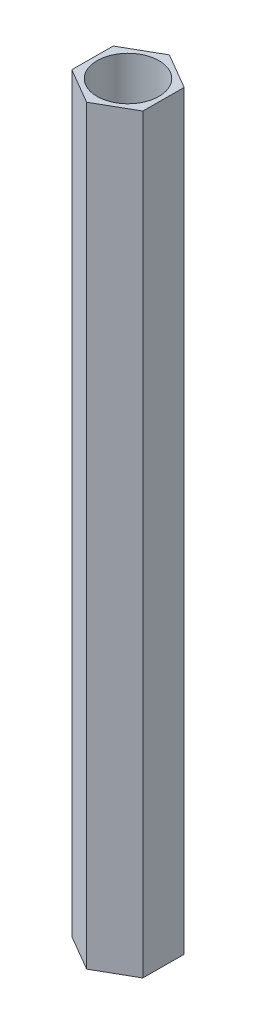
ISO-10303-21;
HEADER;
FILE_DESCRIPTION(('STEP AP214'),'2;1');
FILE_NAME('part.step','',(''),(''),'','','');
FILE_SCHEMA(('AUTOMOTIVE_DESIGN { 1 0 10303 214 1 1 1 1 }'));
ENDSEC;
DATA;
#1=APPLICATION_CONTEXT('core data for automotive mechanical design processes');
#2=APPLICATION_PROTOCOL_DEFINITION('international standard','automotive_design',2000,#1);
#3=PRODUCT_CONTEXT('',#1,'mechanical');
#4=PRODUCT('Part','Part','',(#3));
#5=PRODUCT_RELATED_PRODUCT_CATEGORY('part','',(#4));
#6=PRODUCT_DEFINITION_FORMATION('','',#4);
#7=PRODUCT_DEFINITION_CONTEXT('part definition',#1,'design');
#8=PRODUCT_DEFINITION('design','',#6,#7);
#9=PRODUCT_DEFINITION_SHAPE('','',#8);
#10=(LENGTH_UNIT() NAMED_UNIT(*) SI_UNIT(.MILLI.,.METRE.));
#11=(NAMED_UNIT(*) PLANE_ANGLE_UNIT() SI_UNIT($,.RADIAN.));
#12=(NAMED_UNIT(*) SI_UNIT($,.STERADIAN.) SOLID_ANGLE_UNIT());
#13=UNCERTAINTY_MEASURE_WITH_UNIT(LENGTH_MEASURE(1.E-05),#10,'distance_accuracy_value','');
#14=(GEOMETRIC_REPRESENTATION_CONTEXT(3) GLOBAL_UNCERTAINTY_ASSIGNED_CONTEXT((#13)) GLOBAL_UNIT_ASSIGNED_CONTEXT((#10,
#11,#12)) REPRESENTATION_CONTEXT('',''));
#15=CARTESIAN_POINT('',(0.,0.,0.));
#16=DIRECTION('',(0.,0.,1.));
#17=DIRECTION('',(1.,0.,0.));
#18=AXIS2_PLACEMENT_3D('',#15,#16,#17);
#19=CARTESIAN_POINT('',(0.,40.,0.));
#20=DIRECTION('',(0.,1.,0.));
#21=DIRECTION('',(0.,0.,1.));
#22=AXIS2_PLACEMENT_3D('',#19,#20,#21);
#23=PLANE('',#22);
#24=DIRECTION('',(0.868520271452381,0.,-0.495653647294442));
#25=VECTOR('',#24,1.);
#26=CARTESIAN_POINT('',(-0.0109948539279505,40.,2.19390347247103));
#27=LINE('',#26,#25);
#28=CARTESIAN_POINT('',(-0.0109948539279505,40.,2.19390347247103));
#29=VERTEX_POINT('',#28);
#30=CARTESIAN_POINT('',(1.89447871364683,40.,1.10647355904802));
#31=VERTEX_POINT('',#30);
#32=EDGE_CURVE('E129',#29,#31,#27,.T.);
#33=ORIENTED_EDGE('',*,*,#32,.T.);
#34=DIRECTION('',(0.00501148569079173,0.,-0.999987442426739));
#35=VECTOR('',#34,1.);
#36=CARTESIAN_POINT('',(1.89447871364683,40.,1.10647355904802));
#37=LINE('',#36,#35);
#38=CARTESIAN_POINT('',(1.90547356757478,40.,-1.08742991342301));
#39=VERTEX_POINT('',#38);
#40=EDGE_CURVE('E87',#31,#39,#37,.T.);
#41=ORIENTED_EDGE('',*,*,#40,.T.);
#42=DIRECTION('',(-0.863508785761589,0.,-0.504333795132298));
#43=VECTOR('',#42,1.);
#44=CARTESIAN_POINT('',(1.90547356757478,40.,-1.08742991342301));
#45=LINE('',#44,#43);
#46=CARTESIAN_POINT('',(0.0109948539279514,40.,-2.19390347247103));
#47=VERTEX_POINT('',#46);
#48=EDGE_CURVE('E100',#39,#47,#45,.T.);
#49=ORIENTED_EDGE('',*,*,#48,.T.);
#50=DIRECTION('',(-0.868520271452381,0.,0.495653647294441));
#51=VECTOR('',#50,1.);
#52=CARTESIAN_POINT('',(0.0109948539279514,40.,-2.19390347247103));
#53=LINE('',#52,#51);
#54=CARTESIAN_POINT('',(-1.89447871364683,40.,-1.10647355904802));
#55=VERTEX_POINT('',#54);
#56=EDGE_CURVE('E94',#47,#55,#53,.T.);
#57=ORIENTED_EDGE('',*,*,#56,.T.);
#58=DIRECTION('',(-0.00501148569079203,0.,0.999987442426739));
#59=VECTOR('',#58,1.);
#60=CARTESIAN_POINT('',(-1.89447871364683,40.,-1.10647355904802));
#61=LINE('',#60,#59);
#62=CARTESIAN_POINT('',(-1.90547356757478,40.,1.08742991342301));
#63=VERTEX_POINT('',#62);
#64=EDGE_CURVE('E98',#55,#63,#61,.T.);
#65=ORIENTED_EDGE('',*,*,#64,.T.);
#66=DIRECTION('',(0.863508785761589,0.,0.504333795132298));
#67=VECTOR('',#66,1.);
#68=CARTESIAN_POINT('',(-1.90547356757478,40.,1.08742991342301));
#69=LINE('',#68,#67);
#70=EDGE_CURVE('E50',#63,#29,#69,.T.);
#71=ORIENTED_EDGE('',*,*,#70,.T.);
#72=EDGE_LOOP('',(#33,#41,#49,#57,#65,#71));
#73=FACE_BOUND('',#72,.T.);
#74=CARTESIAN_POINT('',(0.,40.,0.));
#75=DIRECTION('',(0.,1.,0.));
#76=DIRECTION('',(0.,0.,1.));
#77=AXIS2_PLACEMENT_3D('',#74,#75,#76);
#78=CIRCLE('',#77,1.65);
#79=CARTESIAN_POINT('',(0.,40.,1.65));
#80=VERTEX_POINT('',#79);
#81=EDGE_CURVE('E122',#80,#80,#78,.T.);
#82=ORIENTED_EDGE('',*,*,#81,.F.);
#83=EDGE_LOOP('',(#82));
#84=FACE_BOUND('',#83,.T.);
#85=ADVANCED_FACE('F33',(#73,#84),#23,.T.);
#86=CARTESIAN_POINT('',(0.,0.,0.));
#87=DIRECTION('',(0.,1.,0.));
#88=DIRECTION('',(0.,0.,1.));
#89=AXIS2_PLACEMENT_3D('',#86,#87,#88);
#90=PLANE('',#89);
#91=DIRECTION('',(0.868520271452381,0.,-0.495653647294442));
#92=VECTOR('',#91,1.);
#93=CARTESIAN_POINT('',(-0.0109948539279505,0.,2.19390347247103));
#94=LINE('',#93,#92);
#95=CARTESIAN_POINT('',(-0.0109948539279505,0.,2.19390347247103));
#96=VERTEX_POINT('',#95);
#97=CARTESIAN_POINT('',(1.89447871364683,0.,1.10647355904802));
#98=VERTEX_POINT('',#97);
#99=EDGE_CURVE('E118',#96,#98,#94,.T.);
#100=ORIENTED_EDGE('',*,*,#99,.F.);
#101=DIRECTION('',(0.863508785761589,0.,0.504333795132298));
#102=VECTOR('',#101,1.);
#103=CARTESIAN_POINT('',(-1.90547356757478,0.,1.08742991342301));
#104=LINE('',#103,#102);
#105=CARTESIAN_POINT('',(-1.90547356757478,0.,1.08742991342301));
#106=VERTEX_POINT('',#105);
#107=EDGE_CURVE('E79',#106,#96,#104,.T.);
#108=ORIENTED_EDGE('',*,*,#107,.F.);
#109=DIRECTION('',(-0.00501148569079203,0.,0.999987442426739));
#110=VECTOR('',#109,1.);
#111=CARTESIAN_POINT('',(-1.89447871364683,0.,-1.10647355904802));
#112=LINE('',#111,#110);
#113=CARTESIAN_POINT('',(-1.89447871364683,0.,-1.10647355904802));
#114=VERTEX_POINT('',#113);
#115=EDGE_CURVE('E73',#114,#106,#112,.T.);
#116=ORIENTED_EDGE('',*,*,#115,.F.);
#117=DIRECTION('',(-0.868520271452381,0.,0.495653647294441));
#118=VECTOR('',#117,1.);
#119=CARTESIAN_POINT('',(0.0109948539279514,0.,-2.19390347247103));
#120=LINE('',#119,#118);
#121=CARTESIAN_POINT('',(0.0109948539279514,0.,-2.19390347247103));
#122=VERTEX_POINT('',#121);
#123=EDGE_CURVE('E108',#122,#114,#120,.T.);
#124=ORIENTED_EDGE('',*,*,#123,.F.);
#125=DIRECTION('',(-0.863508785761589,0.,-0.504333795132298));
#126=VECTOR('',#125,1.);
#127=CARTESIAN_POINT('',(1.90547356757478,0.,-1.08742991342301));
#128=LINE('',#127,#126);
#129=CARTESIAN_POINT('',(1.90547356757478,0.,-1.08742991342301));
#130=VERTEX_POINT('',#129);
#131=EDGE_CURVE('E124',#130,#122,#128,.T.);
#132=ORIENTED_EDGE('',*,*,#131,.F.);
#133=DIRECTION('',(0.00501148569079173,0.,-0.999987442426739));
#134=VECTOR('',#133,1.);
#135=CARTESIAN_POINT('',(1.89447871364683,0.,1.10647355904802));
#136=LINE('',#135,#134);
#137=EDGE_CURVE('E121',#98,#130,#136,.T.);
#138=ORIENTED_EDGE('',*,*,#137,.F.);
#139=EDGE_LOOP('',(#100,#108,#116,#124,#132,#138));
#140=FACE_BOUND('',#139,.T.);
#141=CARTESIAN_POINT('',(0.,0.,0.));
#142=DIRECTION('',(0.,1.,0.));
#143=DIRECTION('',(0.,0.,1.));
#144=AXIS2_PLACEMENT_3D('',#141,#142,#143);
#145=CIRCLE('',#144,1.65);
#146=CARTESIAN_POINT('',(0.,0.,1.65));
#147=VERTEX_POINT('',#146);
#148=EDGE_CURVE('E222',#147,#147,#145,.T.);
#149=ORIENTED_EDGE('',*,*,#148,.T.);
#150=EDGE_LOOP('',(#149));
#151=FACE_BOUND('',#150,.T.);
#152=ADVANCED_FACE('F138',(#140,#151),#90,.F.);
#153=CARTESIAN_POINT('',(-0.0109948539279505,40.,2.19390347247103));
#154=DIRECTION('',(-0.495653647294442,0.,-0.868520271452381));
#155=DIRECTION('',(-0.868520271452381,0.,0.495653647294442));
#156=AXIS2_PLACEMENT_3D('',#153,#154,#155);
#157=PLANE('',#156);
#158=ORIENTED_EDGE('',*,*,#99,.T.);
#159=DIRECTION('',(0.,-1.,0.));
#160=VECTOR('',#159,1.);
#161=CARTESIAN_POINT('',(1.89447871364683,40.,1.10647355904802));
#162=LINE('',#161,#160);
#163=EDGE_CURVE('E11',#31,#98,#162,.T.);
#164=ORIENTED_EDGE('',*,*,#163,.F.);
#165=ORIENTED_EDGE('',*,*,#32,.F.);
#166=DIRECTION('',(0.,-1.,0.));
#167=VECTOR('',#166,1.);
#168=CARTESIAN_POINT('',(-0.0109948539279505,40.,2.19390347247103));
#169=LINE('',#168,#167);
#170=EDGE_CURVE('E114',#29,#96,#169,.T.);
#171=ORIENTED_EDGE('',*,*,#170,.T.);
#172=EDGE_LOOP('',(#158,#164,#165,#171));
#173=FACE_BOUND('',#172,.T.);
#174=ADVANCED_FACE('F35',(#173),#157,.F.);
#175=CARTESIAN_POINT('',(1.89447871364683,40.,1.10647355904802));
#176=DIRECTION('',(-0.999987442426739,0.,-0.00501148569079173));
#177=DIRECTION('',(-0.00501148569079173,0.,0.999987442426739));
#178=AXIS2_PLACEMENT_3D('',#175,#176,#177);
#179=PLANE('',#178);
#180=ORIENTED_EDGE('',*,*,#137,.T.);
#181=DIRECTION('',(0.,-1.,0.));
#182=VECTOR('',#181,1.);
#183=CARTESIAN_POINT('',(1.90547356757478,40.,-1.08742991342301));
#184=LINE('',#183,#182);
#185=EDGE_CURVE('E42',#39,#130,#184,.T.);
#186=ORIENTED_EDGE('',*,*,#185,.F.);
#187=ORIENTED_EDGE('',*,*,#40,.F.);
#188=ORIENTED_EDGE('',*,*,#163,.T.);
#189=EDGE_LOOP('',(#180,#186,#187,#188));
#190=FACE_BOUND('',#189,.T.);
#191=ADVANCED_FACE('F163',(#190),#179,.F.);
#192=CARTESIAN_POINT('',(1.90547356757478,40.,-1.08742991342301));
#193=DIRECTION('',(-0.504333795132298,0.,0.863508785761589));
#194=DIRECTION('',(0.863508785761589,0.,0.504333795132298));
#195=AXIS2_PLACEMENT_3D('',#192,#193,#194);
#196=PLANE('',#195);
#197=ORIENTED_EDGE('',*,*,#131,.T.);
#198=DIRECTION('',(0.,-1.,0.));
#199=VECTOR('',#198,1.);
#200=CARTESIAN_POINT('',(0.0109948539279514,40.,-2.19390347247103));
#201=LINE('',#200,#199);
#202=EDGE_CURVE('E109',#47,#122,#201,.T.);
#203=ORIENTED_EDGE('',*,*,#202,.F.);
#204=ORIENTED_EDGE('',*,*,#48,.F.);
#205=ORIENTED_EDGE('',*,*,#185,.T.);
#206=EDGE_LOOP('',(#197,#203,#204,#205));
#207=FACE_BOUND('',#206,.T.);
#208=ADVANCED_FACE('F135',(#207),#196,.F.);
#209=CARTESIAN_POINT('',(0.0109948539279514,40.,-2.19390347247103));
#210=DIRECTION('',(0.495653647294441,0.,0.868520271452381));
#211=DIRECTION('',(0.868520271452381,0.,-0.495653647294441));
#212=AXIS2_PLACEMENT_3D('',#209,#210,#211);
#213=PLANE('',#212);
#214=ORIENTED_EDGE('',*,*,#123,.T.);
#215=DIRECTION('',(0.,-1.,0.));
#216=VECTOR('',#215,1.);
#217=CARTESIAN_POINT('',(-1.89447871364683,40.,-1.10647355904802));
#218=LINE('',#217,#216);
#219=EDGE_CURVE('E105',#55,#114,#218,.T.);
#220=ORIENTED_EDGE('',*,*,#219,.F.);
#221=ORIENTED_EDGE('',*,*,#56,.F.);
#222=ORIENTED_EDGE('',*,*,#202,.T.);
#223=EDGE_LOOP('',(#214,#220,#221,#222));
#224=FACE_BOUND('',#223,.T.);
#225=ADVANCED_FACE('F106',(#224),#213,.F.);
#226=CARTESIAN_POINT('',(-1.89447871364683,40.,-1.10647355904802));
#227=DIRECTION('',(0.999987442426739,0.,0.00501148569079203));
#228=DIRECTION('',(0.00501148569079203,0.,-0.999987442426739));
#229=AXIS2_PLACEMENT_3D('',#226,#227,#228);
#230=PLANE('',#229);
#231=ORIENTED_EDGE('',*,*,#115,.T.);
#232=DIRECTION('',(0.,-1.,0.));
#233=VECTOR('',#232,1.);
#234=CARTESIAN_POINT('',(-1.90547356757478,40.,1.08742991342301));
#235=LINE('',#234,#233);
#236=EDGE_CURVE('E110',#63,#106,#235,.T.);
#237=ORIENTED_EDGE('',*,*,#236,.F.);
#238=ORIENTED_EDGE('',*,*,#64,.F.);
#239=ORIENTED_EDGE('',*,*,#219,.T.);
#240=EDGE_LOOP('',(#231,#237,#238,#239));
#241=FACE_BOUND('',#240,.T.);
#242=ADVANCED_FACE('F112',(#241),#230,.F.);
#243=CARTESIAN_POINT('',(-1.90547356757478,40.,1.08742991342301));
#244=DIRECTION('',(0.504333795132298,0.,-0.863508785761589));
#245=DIRECTION('',(-0.863508785761589,0.,-0.504333795132298));
#246=AXIS2_PLACEMENT_3D('',#243,#244,#245);
#247=PLANE('',#246);
#248=ORIENTED_EDGE('',*,*,#107,.T.);
#249=ORIENTED_EDGE('',*,*,#170,.F.);
#250=ORIENTED_EDGE('',*,*,#70,.F.);
#251=ORIENTED_EDGE('',*,*,#236,.T.);
#252=EDGE_LOOP('',(#248,#249,#250,#251));
#253=FACE_BOUND('',#252,.T.);
#254=ADVANCED_FACE('F143',(#253),#247,.F.);
#255=CARTESIAN_POINT('',(0.,40.,0.));
#256=DIRECTION('',(0.,-1.,0.));
#257=DIRECTION('',(0.,0.,-1.));
#258=AXIS2_PLACEMENT_3D('',#255,#256,#257);
#259=CYLINDRICAL_SURFACE('',#258,1.65);
#260=ORIENTED_EDGE('',*,*,#81,.T.);
#261=EDGE_LOOP('',(#260));
#262=FACE_BOUND('',#261,.T.);
#263=ORIENTED_EDGE('',*,*,#148,.F.);
#264=EDGE_LOOP('',(#263));
#265=FACE_BOUND('',#264,.T.);
#266=ADVANCED_FACE('F145',(#262,#265),#259,.F.);
#267=CLOSED_SHELL('',(#85,#152,#174,#191,#208,#225,#242,#254,#266));
#268=MANIFOLD_SOLID_BREP('B2',#267);
#269=ADVANCED_BREP_SHAPE_REPRESENTATION('',(#18,#268),#14);
#270=SHAPE_DEFINITION_REPRESENTATION(#9,#269);
ENDSEC;
END-ISO-10303-21;
